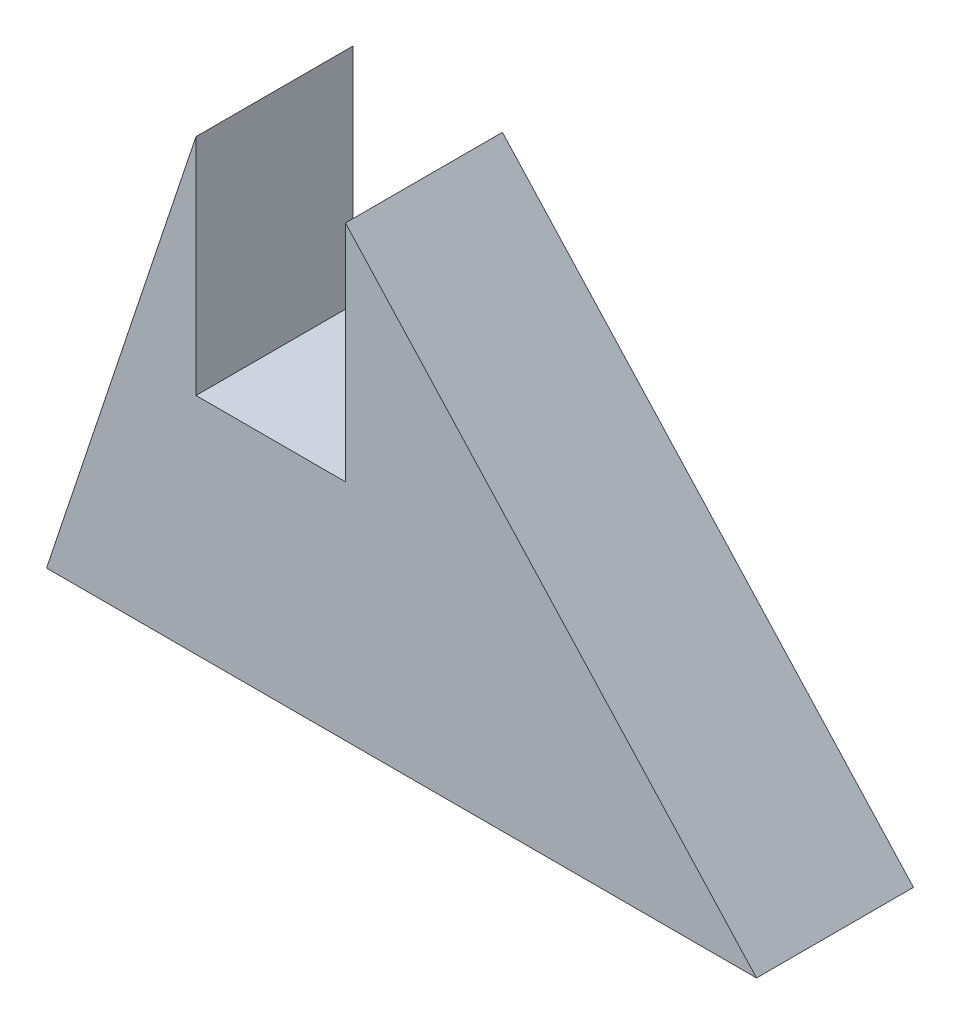
ISO-10303-21;
HEADER;
FILE_DESCRIPTION(('STEP AP214'),'2;1');
FILE_NAME('part.step','',(''),(''),'','','');
FILE_SCHEMA(('AUTOMOTIVE_DESIGN { 1 0 10303 214 1 1 1 1 }'));
ENDSEC;
DATA;
#1=APPLICATION_CONTEXT('core data for automotive mechanical design processes');
#2=APPLICATION_PROTOCOL_DEFINITION('international standard','automotive_design',2000,#1);
#3=PRODUCT_CONTEXT('',#1,'mechanical');
#4=PRODUCT('Part','Part','',(#3));
#5=PRODUCT_RELATED_PRODUCT_CATEGORY('part','',(#4));
#6=PRODUCT_DEFINITION_FORMATION('','',#4);
#7=PRODUCT_DEFINITION_CONTEXT('part definition',#1,'design');
#8=PRODUCT_DEFINITION('design','',#6,#7);
#9=PRODUCT_DEFINITION_SHAPE('','',#8);
#10=(LENGTH_UNIT() NAMED_UNIT(*) SI_UNIT(.MILLI.,.METRE.));
#11=(NAMED_UNIT(*) PLANE_ANGLE_UNIT() SI_UNIT($,.RADIAN.));
#12=(NAMED_UNIT(*) SI_UNIT($,.STERADIAN.) SOLID_ANGLE_UNIT());
#13=UNCERTAINTY_MEASURE_WITH_UNIT(LENGTH_MEASURE(1.E-05),#10,'distance_accuracy_value','');
#14=(GEOMETRIC_REPRESENTATION_CONTEXT(3) GLOBAL_UNCERTAINTY_ASSIGNED_CONTEXT((#13)) GLOBAL_UNIT_ASSIGNED_CONTEXT((#10,
#11,#12)) REPRESENTATION_CONTEXT('',''));
#15=CARTESIAN_POINT('',(0.,0.,0.));
#16=DIRECTION('',(0.,0.,1.));
#17=DIRECTION('',(1.,0.,0.));
#18=AXIS2_PLACEMENT_3D('',#15,#16,#17);
#19=CARTESIAN_POINT('',(40.,0.,21.));
#20=DIRECTION('',(0.,1.,0.));
#21=DIRECTION('',(0.,0.,1.));
#22=AXIS2_PLACEMENT_3D('',#19,#20,#21);
#23=PLANE('',#22);
#24=DIRECTION('',(1.,0.,0.));
#25=VECTOR('',#24,1.);
#26=CARTESIAN_POINT('',(40.,0.,0.));
#27=LINE('',#26,#25);
#28=CARTESIAN_POINT('',(0.,0.,0.));
#29=VERTEX_POINT('',#28);
#30=CARTESIAN_POINT('',(95.,0.,0.));
#31=VERTEX_POINT('',#30);
#32=EDGE_CURVE('E73',#29,#31,#27,.T.);
#33=ORIENTED_EDGE('',*,*,#32,.T.);
#34=DIRECTION('',(0.,0.,-1.));
#35=VECTOR('',#34,1.);
#36=CARTESIAN_POINT('',(95.,0.,21.));
#37=LINE('',#36,#35);
#38=CARTESIAN_POINT('',(95.,0.,21.));
#39=VERTEX_POINT('',#38);
#40=EDGE_CURVE('E11',#39,#31,#37,.T.);
#41=ORIENTED_EDGE('',*,*,#40,.F.);
#42=DIRECTION('',(1.,0.,0.));
#43=VECTOR('',#42,1.);
#44=CARTESIAN_POINT('',(0.,0.,21.));
#45=LINE('',#44,#43);
#46=CARTESIAN_POINT('',(0.,0.,21.));
#47=VERTEX_POINT('',#46);
#48=EDGE_CURVE('E95',#47,#39,#45,.T.);
#49=ORIENTED_EDGE('',*,*,#48,.F.);
#50=DIRECTION('',(0.,0.,-1.));
#51=VECTOR('',#50,1.);
#52=CARTESIAN_POINT('',(0.,0.,21.));
#53=LINE('',#52,#51);
#54=EDGE_CURVE('E91',#47,#29,#53,.T.);
#55=ORIENTED_EDGE('',*,*,#54,.T.);
#56=EDGE_LOOP('',(#33,#41,#49,#55));
#57=FACE_BOUND('',#56,.T.);
#58=ADVANCED_FACE('F37',(#57),#23,.F.);
#59=CARTESIAN_POINT('',(40.,60.,21.));
#60=DIRECTION('',(-0.737154140200741,-0.675724628517346,0.));
#61=DIRECTION('',(0.675724628517346,-0.737154140200741,0.));
#62=AXIS2_PLACEMENT_3D('',#59,#60,#61);
#63=PLANE('',#62);
#64=DIRECTION('',(-0.675724628517346,0.737154140200741,0.));
#65=VECTOR('',#64,1.);
#66=CARTESIAN_POINT('',(40.,60.,0.));
#67=LINE('',#66,#65);
#68=CARTESIAN_POINT('',(40.,60.,0.));
#69=VERTEX_POINT('',#68);
#70=EDGE_CURVE('E82',#31,#69,#67,.T.);
#71=ORIENTED_EDGE('',*,*,#70,.T.);
#72=DIRECTION('',(0.,0.,-1.));
#73=VECTOR('',#72,1.);
#74=CARTESIAN_POINT('',(40.,60.,21.));
#75=LINE('',#74,#73);
#76=CARTESIAN_POINT('',(40.,60.,21.));
#77=VERTEX_POINT('',#76);
#78=EDGE_CURVE('E44',#77,#69,#75,.T.);
#79=ORIENTED_EDGE('',*,*,#78,.F.);
#80=DIRECTION('',(-0.675724628517346,0.737154140200741,0.));
#81=VECTOR('',#80,1.);
#82=CARTESIAN_POINT('',(40.,60.,21.));
#83=LINE('',#82,#81);
#84=EDGE_CURVE('E99',#39,#77,#83,.T.);
#85=ORIENTED_EDGE('',*,*,#84,.F.);
#86=ORIENTED_EDGE('',*,*,#40,.T.);
#87=EDGE_LOOP('',(#71,#79,#85,#86));
#88=FACE_BOUND('',#87,.T.);
#89=ADVANCED_FACE('F120',(#88),#63,.F.);
#90=CARTESIAN_POINT('',(0.,0.,21.));
#91=DIRECTION('',(0.948683298050514,-0.316227766016838,0.));
#92=DIRECTION('',(0.316227766016838,0.948683298050514,0.));
#93=AXIS2_PLACEMENT_3D('',#90,#91,#92);
#94=PLANE('',#93);
#95=DIRECTION('',(-0.316227766016838,-0.948683298050514,0.));
#96=VECTOR('',#95,1.);
#97=CARTESIAN_POINT('',(0.,0.,0.));
#98=LINE('',#97,#96);
#99=CARTESIAN_POINT('',(20.,60.,0.));
#100=VERTEX_POINT('',#99);
#101=EDGE_CURVE('E79',#100,#29,#98,.T.);
#102=ORIENTED_EDGE('',*,*,#101,.T.);
#103=ORIENTED_EDGE('',*,*,#54,.F.);
#104=DIRECTION('',(-0.316227766016838,-0.948683298050514,0.));
#105=VECTOR('',#104,1.);
#106=CARTESIAN_POINT('',(0.,0.,21.));
#107=LINE('',#106,#105);
#108=CARTESIAN_POINT('',(20.,60.,21.));
#109=VERTEX_POINT('',#108);
#110=EDGE_CURVE('E60',#109,#47,#107,.T.);
#111=ORIENTED_EDGE('',*,*,#110,.F.);
#112=DIRECTION('',(0.,0.,-1.));
#113=VECTOR('',#112,1.);
#114=CARTESIAN_POINT('',(20.,60.,21.));
#115=LINE('',#114,#113);
#116=EDGE_CURVE('E94',#109,#100,#115,.T.);
#117=ORIENTED_EDGE('',*,*,#116,.T.);
#118=EDGE_LOOP('',(#102,#103,#111,#117));
#119=FACE_BOUND('',#118,.T.);
#120=ADVANCED_FACE('F90',(#119),#94,.F.);
#121=CARTESIAN_POINT('',(0.,0.,21.));
#122=DIRECTION('',(0.,0.,1.));
#123=DIRECTION('',(1.,0.,0.));
#124=AXIS2_PLACEMENT_3D('',#121,#122,#123);
#125=PLANE('',#124);
#126=DIRECTION('',(0.,1.,0.));
#127=VECTOR('',#126,1.);
#128=CARTESIAN_POINT('',(40.,60.,21.));
#129=LINE('',#128,#127);
#130=CARTESIAN_POINT('',(40.,30.,21.));
#131=VERTEX_POINT('',#130);
#132=EDGE_CURVE('E114',#131,#77,#129,.T.);
#133=ORIENTED_EDGE('',*,*,#132,.F.);
#134=DIRECTION('',(1.,0.,0.));
#135=VECTOR('',#134,1.);
#136=CARTESIAN_POINT('',(40.,30.,21.));
#137=LINE('',#136,#135);
#138=CARTESIAN_POINT('',(20.,30.,21.));
#139=VERTEX_POINT('',#138);
#140=EDGE_CURVE('E129',#139,#131,#137,.T.);
#141=ORIENTED_EDGE('',*,*,#140,.F.);
#142=DIRECTION('',(0.,-1.,0.));
#143=VECTOR('',#142,1.);
#144=CARTESIAN_POINT('',(20.,60.,21.));
#145=LINE('',#144,#143);
#146=EDGE_CURVE('E132',#109,#139,#145,.T.);
#147=ORIENTED_EDGE('',*,*,#146,.F.);
#148=ORIENTED_EDGE('',*,*,#110,.T.);
#149=ORIENTED_EDGE('',*,*,#48,.T.);
#150=ORIENTED_EDGE('',*,*,#84,.T.);
#151=EDGE_LOOP('',(#133,#141,#147,#148,#149,#150));
#152=FACE_BOUND('',#151,.T.);
#153=ADVANCED_FACE('F147',(#152),#125,.T.);
#154=CARTESIAN_POINT('',(0.,0.,0.));
#155=DIRECTION('',(0.,0.,1.));
#156=DIRECTION('',(1.,0.,0.));
#157=AXIS2_PLACEMENT_3D('',#154,#155,#156);
#158=PLANE('',#157);
#159=DIRECTION('',(-1.,0.,0.));
#160=VECTOR('',#159,1.);
#161=CARTESIAN_POINT('',(40.,30.,0.));
#162=LINE('',#161,#160);
#163=CARTESIAN_POINT('',(40.,30.,0.));
#164=VERTEX_POINT('',#163);
#165=CARTESIAN_POINT('',(20.,30.,0.));
#166=VERTEX_POINT('',#165);
#167=EDGE_CURVE('E118',#164,#166,#162,.T.);
#168=ORIENTED_EDGE('',*,*,#167,.F.);
#169=DIRECTION('',(0.,-1.,0.));
#170=VECTOR('',#169,1.);
#171=CARTESIAN_POINT('',(40.,60.,0.));
#172=LINE('',#171,#170);
#173=EDGE_CURVE('E110',#69,#164,#172,.T.);
#174=ORIENTED_EDGE('',*,*,#173,.F.);
#175=ORIENTED_EDGE('',*,*,#70,.F.);
#176=ORIENTED_EDGE('',*,*,#32,.F.);
#177=ORIENTED_EDGE('',*,*,#101,.F.);
#178=DIRECTION('',(0.,1.,0.));
#179=VECTOR('',#178,1.);
#180=CARTESIAN_POINT('',(20.,60.,0.));
#181=LINE('',#180,#179);
#182=EDGE_CURVE('E86',#166,#100,#181,.T.);
#183=ORIENTED_EDGE('',*,*,#182,.F.);
#184=EDGE_LOOP('',(#168,#174,#175,#176,#177,#183));
#185=FACE_BOUND('',#184,.T.);
#186=ADVANCED_FACE('F76',(#185),#158,.F.);
#187=CARTESIAN_POINT('',(40.,60.,-36.0555127546399));
#188=DIRECTION('',(1.,0.,0.));
#189=DIRECTION('',(0.,0.,-1.));
#190=AXIS2_PLACEMENT_3D('',#187,#188,#189);
#191=PLANE('',#190);
#192=ORIENTED_EDGE('',*,*,#173,.T.);
#193=DIRECTION('',(0.,0.,1.));
#194=VECTOR('',#193,1.);
#195=CARTESIAN_POINT('',(40.,30.,-36.0555127546399));
#196=LINE('',#195,#194);
#197=EDGE_CURVE('E126',#164,#131,#196,.T.);
#198=ORIENTED_EDGE('',*,*,#197,.T.);
#199=ORIENTED_EDGE('',*,*,#132,.T.);
#200=ORIENTED_EDGE('',*,*,#78,.T.);
#201=EDGE_LOOP('',(#192,#198,#199,#200));
#202=FACE_BOUND('',#201,.T.);
#203=ADVANCED_FACE('F108',(#202),#191,.F.);
#204=CARTESIAN_POINT('',(40.,30.,-36.0555127546399));
#205=DIRECTION('',(0.,-1.,0.));
#206=DIRECTION('',(0.,0.,-1.));
#207=AXIS2_PLACEMENT_3D('',#204,#205,#206);
#208=PLANE('',#207);
#209=ORIENTED_EDGE('',*,*,#167,.T.);
#210=DIRECTION('',(0.,0.,1.));
#211=VECTOR('',#210,1.);
#212=CARTESIAN_POINT('',(20.,30.,-36.0555127546399));
#213=LINE('',#212,#211);
#214=EDGE_CURVE('E51',#166,#139,#213,.T.);
#215=ORIENTED_EDGE('',*,*,#214,.T.);
#216=ORIENTED_EDGE('',*,*,#140,.T.);
#217=ORIENTED_EDGE('',*,*,#197,.F.);
#218=EDGE_LOOP('',(#209,#215,#216,#217));
#219=FACE_BOUND('',#218,.T.);
#220=ADVANCED_FACE('F135',(#219),#208,.F.);
#221=CARTESIAN_POINT('',(20.,60.,-36.0555127546399));
#222=DIRECTION('',(-1.,0.,0.));
#223=DIRECTION('',(0.,-1.,0.));
#224=AXIS2_PLACEMENT_3D('',#221,#222,#223);
#225=PLANE('',#224);
#226=ORIENTED_EDGE('',*,*,#182,.T.);
#227=ORIENTED_EDGE('',*,*,#116,.F.);
#228=ORIENTED_EDGE('',*,*,#146,.T.);
#229=ORIENTED_EDGE('',*,*,#214,.F.);
#230=EDGE_LOOP('',(#226,#227,#228,#229));
#231=FACE_BOUND('',#230,.T.);
#232=ADVANCED_FACE('F137',(#231),#225,.F.);
#233=CLOSED_SHELL('',(#58,#89,#120,#153,#186,#203,#220,#232));
#234=MANIFOLD_SOLID_BREP('B2',#233);
#235=ADVANCED_BREP_SHAPE_REPRESENTATION('',(#18,#234),#14);
#236=SHAPE_DEFINITION_REPRESENTATION(#9,#235);
ENDSEC;
END-ISO-10303-21;
